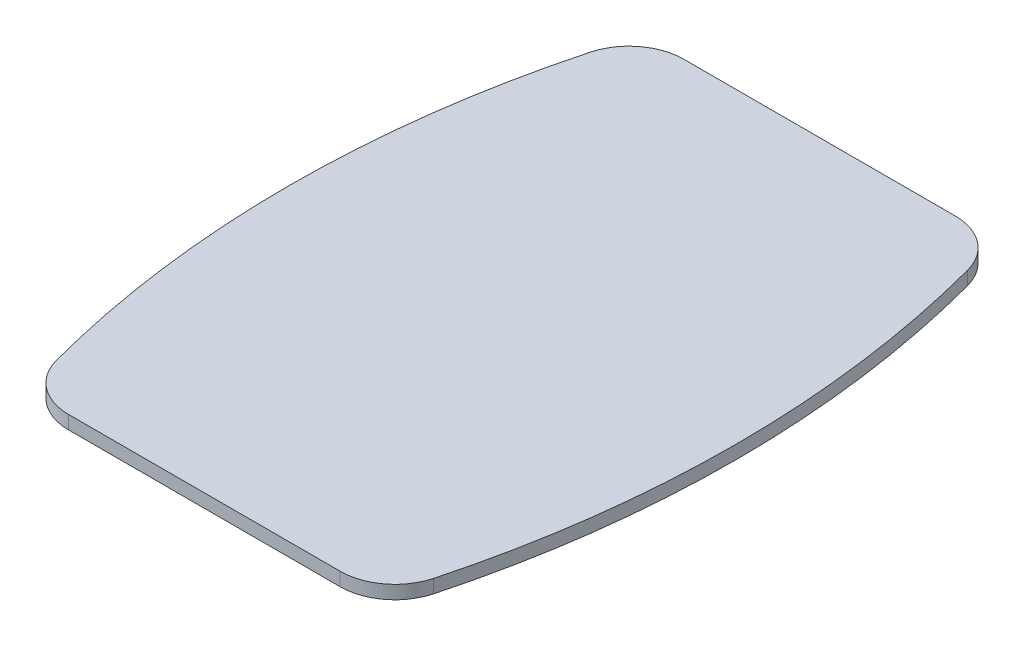
ISO-10303-21;
HEADER;
FILE_DESCRIPTION(('STEP AP214'),'2;1');
FILE_NAME('part.step','',(''),(''),'','','');
FILE_SCHEMA(('AUTOMOTIVE_DESIGN { 1 0 10303 214 1 1 1 1 }'));
ENDSEC;
DATA;
#1=APPLICATION_CONTEXT('core data for automotive mechanical design processes');
#2=APPLICATION_PROTOCOL_DEFINITION('international standard','automotive_design',2000,#1);
#3=PRODUCT_CONTEXT('',#1,'mechanical');
#4=PRODUCT('Part','Part','',(#3));
#5=PRODUCT_RELATED_PRODUCT_CATEGORY('part','',(#4));
#6=PRODUCT_DEFINITION_FORMATION('','',#4);
#7=PRODUCT_DEFINITION_CONTEXT('part definition',#1,'design');
#8=PRODUCT_DEFINITION('design','',#6,#7);
#9=PRODUCT_DEFINITION_SHAPE('','',#8);
#10=(LENGTH_UNIT() NAMED_UNIT(*) SI_UNIT(.MILLI.,.METRE.));
#11=(NAMED_UNIT(*) PLANE_ANGLE_UNIT() SI_UNIT($,.RADIAN.));
#12=(NAMED_UNIT(*) SI_UNIT($,.STERADIAN.) SOLID_ANGLE_UNIT());
#13=UNCERTAINTY_MEASURE_WITH_UNIT(LENGTH_MEASURE(1.E-05),#10,'distance_accuracy_value','');
#14=(GEOMETRIC_REPRESENTATION_CONTEXT(3) GLOBAL_UNCERTAINTY_ASSIGNED_CONTEXT((#13)) GLOBAL_UNIT_ASSIGNED_CONTEXT((#10,
#11,#12)) REPRESENTATION_CONTEXT('',''));
#15=CARTESIAN_POINT('',(0.,0.,0.));
#16=DIRECTION('',(0.,0.,1.));
#17=DIRECTION('',(1.,0.,0.));
#18=AXIS2_PLACEMENT_3D('',#15,#16,#17);
#19=CARTESIAN_POINT('',(-12.1418790973248,-12.7,22.60959767014));
#20=DIRECTION('',(0.,-1.,0.));
#21=DIRECTION('',(0.,0.,-1.));
#22=AXIS2_PLACEMENT_3D('',#19,#20,#21);
#23=PLANE('',#22);
#24=CARTESIAN_POINT('',(-12.1418790973248,-12.7,22.60959767014));
#25=DIRECTION('',(0.,-1.,0.));
#26=DIRECTION('',(0.,0.,-1.));
#27=AXIS2_PLACEMENT_3D('',#24,#25,#26);
#28=CIRCLE('',#27,4.9);
#29=CARTESIAN_POINT('',(-12.1418790973248,-12.7,27.50959767014));
#30=VERTEX_POINT('',#29);
#31=CARTESIAN_POINT('',(-16.8758947600633,-12.7,23.8741512296805));
#32=VERTEX_POINT('',#31);
#33=EDGE_CURVE('E124',#30,#32,#28,.T.);
#34=ORIENTED_EDGE('',*,*,#33,.T.);
#35=CARTESIAN_POINT('',(72.4999999999531,-12.7,0.));
#36=DIRECTION('',(0.,-1.,0.));
#37=DIRECTION('',(0.,0.,-1.));
#38=AXIS2_PLACEMENT_3D('',#35,#36,#37);
#39=CIRCLE('',#38,92.5095976701401);
#40=CARTESIAN_POINT('',(-16.8758947600633,-12.7,-23.8741512296804));
#41=VERTEX_POINT('',#40);
#42=EDGE_CURVE('E113',#32,#41,#39,.T.);
#43=ORIENTED_EDGE('',*,*,#42,.T.);
#44=CARTESIAN_POINT('',(-12.1418790973248,-12.7,-22.6095976701399));
#45=DIRECTION('',(0.,-1.,0.));
#46=DIRECTION('',(0.,0.,-1.));
#47=AXIS2_PLACEMENT_3D('',#44,#45,#46);
#48=CIRCLE('',#47,4.90000000000001);
#49=CARTESIAN_POINT('',(-12.1418790973248,-12.7,-27.5095976701399));
#50=VERTEX_POINT('',#49);
#51=EDGE_CURVE('E123',#41,#50,#48,.T.);
#52=ORIENTED_EDGE('',*,*,#51,.T.);
#53=DIRECTION('',(1.,0.,0.));
#54=VECTOR('',#53,1.);
#55=CARTESIAN_POINT('',(-12.1418790973248,-12.7,-27.5095976701399));
#56=LINE('',#55,#54);
#57=CARTESIAN_POINT('',(12.1418790973248,-12.7,-27.50959767014));
#58=VERTEX_POINT('',#57);
#59=EDGE_CURVE('E226',#50,#58,#56,.T.);
#60=ORIENTED_EDGE('',*,*,#59,.T.);
#61=CARTESIAN_POINT('',(12.1418790973248,-12.7,-22.60959767014));
#62=DIRECTION('',(0.,-1.,0.));
#63=DIRECTION('',(0.,0.,-1.));
#64=AXIS2_PLACEMENT_3D('',#61,#62,#63);
#65=CIRCLE('',#64,4.90000000000001);
#66=CARTESIAN_POINT('',(16.8758947600633,-12.7,-23.8741512296805));
#67=VERTEX_POINT('',#66);
#68=EDGE_CURVE('E240',#58,#67,#65,.T.);
#69=ORIENTED_EDGE('',*,*,#68,.T.);
#70=CARTESIAN_POINT('',(-72.4999999999531,-12.7,0.));
#71=DIRECTION('',(0.,-1.,0.));
#72=DIRECTION('',(0.,0.,-1.));
#73=AXIS2_PLACEMENT_3D('',#70,#71,#72);
#74=CIRCLE('',#73,92.5095976701401);
#75=CARTESIAN_POINT('',(16.8758947600633,-12.7,23.8741512296805));
#76=VERTEX_POINT('',#75);
#77=EDGE_CURVE('E238',#67,#76,#74,.T.);
#78=ORIENTED_EDGE('',*,*,#77,.T.);
#79=CARTESIAN_POINT('',(12.1418790973248,-12.7,22.6095976701399));
#80=DIRECTION('',(0.,-1.,0.));
#81=DIRECTION('',(0.,0.,-1.));
#82=AXIS2_PLACEMENT_3D('',#79,#80,#81);
#83=CIRCLE('',#82,4.90000000000002);
#84=CARTESIAN_POINT('',(12.1418790973248,-12.7,27.5095976701399));
#85=VERTEX_POINT('',#84);
#86=EDGE_CURVE('E242',#76,#85,#83,.T.);
#87=ORIENTED_EDGE('',*,*,#86,.T.);
#88=DIRECTION('',(-1.,0.,0.));
#89=VECTOR('',#88,1.);
#90=CARTESIAN_POINT('',(12.1418790973248,-12.7,27.5095976701399));
#91=LINE('',#90,#89);
#92=EDGE_CURVE('E129',#85,#30,#91,.T.);
#93=ORIENTED_EDGE('',*,*,#92,.T.);
#94=EDGE_LOOP('',(#34,#43,#52,#60,#69,#78,#87,#93));
#95=FACE_BOUND('',#94,.T.);
#96=DIRECTION('',(-1.,0.,0.));
#97=VECTOR('',#96,1.);
#98=CARTESIAN_POINT('',(-12.1418790973248,-12.7,-14.8599756298331));
#99=LINE('',#98,#97);
#100=CARTESIAN_POINT('',(14.0299535443694,-12.7,-14.8599756298331));
#101=VERTEX_POINT('',#100);
#102=CARTESIAN_POINT('',(-14.0299535443694,-12.7,-14.8599756298331));
#103=VERTEX_POINT('',#102);
#104=EDGE_CURVE('E49',#101,#103,#99,.T.);
#105=ORIENTED_EDGE('',*,*,#104,.T.);
#106=DIRECTION('',(0.,0.,1.));
#107=VECTOR('',#106,1.);
#108=CARTESIAN_POINT('',(-14.0299535443694,-12.7,22.60959767014));
#109=LINE('',#108,#107);
#110=CARTESIAN_POINT('',(-14.0299535443694,-12.7,20.1999980960807));
#111=VERTEX_POINT('',#110);
#112=EDGE_CURVE('E11',#103,#111,#109,.T.);
#113=ORIENTED_EDGE('',*,*,#112,.T.);
#114=DIRECTION('',(1.,0.,0.));
#115=VECTOR('',#114,1.);
#116=CARTESIAN_POINT('',(-12.1418790973248,-12.7,20.1999980960807));
#117=LINE('',#116,#115);
#118=CARTESIAN_POINT('',(14.0299535443694,-12.7,20.1999980960807));
#119=VERTEX_POINT('',#118);
#120=EDGE_CURVE('E137',#111,#119,#117,.T.);
#121=ORIENTED_EDGE('',*,*,#120,.T.);
#122=DIRECTION('',(0.,0.,-1.));
#123=VECTOR('',#122,1.);
#124=CARTESIAN_POINT('',(14.0299535443694,-12.7,22.60959767014));
#125=LINE('',#124,#123);
#126=EDGE_CURVE('E141',#119,#101,#125,.T.);
#127=ORIENTED_EDGE('',*,*,#126,.T.);
#128=EDGE_LOOP('',(#105,#113,#121,#127));
#129=FACE_BOUND('',#128,.T.);
#130=ADVANCED_FACE('F40',(#95,#129),#23,.T.);
#131=CARTESIAN_POINT('',(-12.1418790973248,-12.7,22.60959767014));
#132=DIRECTION('',(0.,1.,0.));
#133=DIRECTION('',(0.,0.,1.));
#134=AXIS2_PLACEMENT_3D('',#131,#132,#133);
#135=CYLINDRICAL_SURFACE('',#134,4.9);
#136=CARTESIAN_POINT('',(-12.1418790973248,-11.5,22.60959767014));
#137=DIRECTION('',(0.,-1.,0.));
#138=DIRECTION('',(0.,0.,-1.));
#139=AXIS2_PLACEMENT_3D('',#136,#137,#138);
#140=CIRCLE('',#139,4.9);
#141=CARTESIAN_POINT('',(-12.1418790973248,-11.5,27.50959767014));
#142=VERTEX_POINT('',#141);
#143=CARTESIAN_POINT('',(-16.8758947600633,-11.5,23.8741512296805));
#144=VERTEX_POINT('',#143);
#145=EDGE_CURVE('E136',#142,#144,#140,.T.);
#146=ORIENTED_EDGE('',*,*,#145,.T.);
#147=DIRECTION('',(0.,1.,0.));
#148=VECTOR('',#147,1.);
#149=CARTESIAN_POINT('',(-16.8758947600633,-12.7,23.8741512296805));
#150=LINE('',#149,#148);
#151=EDGE_CURVE('E117',#32,#144,#150,.T.);
#152=ORIENTED_EDGE('',*,*,#151,.F.);
#153=ORIENTED_EDGE('',*,*,#33,.F.);
#154=DIRECTION('',(0.,1.,0.));
#155=VECTOR('',#154,1.);
#156=CARTESIAN_POINT('',(-12.1418790973248,-12.7,27.50959767014));
#157=LINE('',#156,#155);
#158=EDGE_CURVE('E208',#30,#142,#157,.T.);
#159=ORIENTED_EDGE('',*,*,#158,.T.);
#160=EDGE_LOOP('',(#146,#152,#153,#159));
#161=FACE_BOUND('',#160,.T.);
#162=ADVANCED_FACE('F42',(#161),#135,.T.);
#163=CARTESIAN_POINT('',(72.4999999999531,-12.7,0.));
#164=DIRECTION('',(0.,1.,0.));
#165=DIRECTION('',(0.,0.,1.));
#166=AXIS2_PLACEMENT_3D('',#163,#164,#165);
#167=CYLINDRICAL_SURFACE('',#166,92.5095976701401);
#168=CARTESIAN_POINT('',(72.4999999999531,-11.5,0.));
#169=DIRECTION('',(0.,-1.,0.));
#170=DIRECTION('',(0.,0.,-1.));
#171=AXIS2_PLACEMENT_3D('',#168,#169,#170);
#172=CIRCLE('',#171,92.5095976701401);
#173=CARTESIAN_POINT('',(-16.8758947600633,-11.5,-23.8741512296804));
#174=VERTEX_POINT('',#173);
#175=EDGE_CURVE('E233',#144,#174,#172,.T.);
#176=ORIENTED_EDGE('',*,*,#175,.T.);
#177=DIRECTION('',(0.,1.,0.));
#178=VECTOR('',#177,1.);
#179=CARTESIAN_POINT('',(-16.8758947600633,-12.7,-23.8741512296804));
#180=LINE('',#179,#178);
#181=EDGE_CURVE('E120',#41,#174,#180,.T.);
#182=ORIENTED_EDGE('',*,*,#181,.F.);
#183=ORIENTED_EDGE('',*,*,#42,.F.);
#184=ORIENTED_EDGE('',*,*,#151,.T.);
#185=EDGE_LOOP('',(#176,#182,#183,#184));
#186=FACE_BOUND('',#185,.T.);
#187=ADVANCED_FACE('F115',(#186),#167,.T.);
#188=CARTESIAN_POINT('',(-12.1418790973248,-12.7,-22.6095976701399));
#189=DIRECTION('',(0.,1.,0.));
#190=DIRECTION('',(0.,0.,1.));
#191=AXIS2_PLACEMENT_3D('',#188,#189,#190);
#192=CYLINDRICAL_SURFACE('',#191,4.90000000000001);
#193=CARTESIAN_POINT('',(-12.1418790973248,-11.5,-22.6095976701399));
#194=DIRECTION('',(0.,-1.,0.));
#195=DIRECTION('',(0.,0.,-1.));
#196=AXIS2_PLACEMENT_3D('',#193,#194,#195);
#197=CIRCLE('',#196,4.90000000000001);
#198=CARTESIAN_POINT('',(-12.1418790973248,-11.5,-27.5095976701399));
#199=VERTEX_POINT('',#198);
#200=EDGE_CURVE('E229',#174,#199,#197,.T.);
#201=ORIENTED_EDGE('',*,*,#200,.T.);
#202=DIRECTION('',(0.,1.,0.));
#203=VECTOR('',#202,1.);
#204=CARTESIAN_POINT('',(-12.1418790973248,-12.7,-27.5095976701399));
#205=LINE('',#204,#203);
#206=EDGE_CURVE('E143',#50,#199,#205,.T.);
#207=ORIENTED_EDGE('',*,*,#206,.F.);
#208=ORIENTED_EDGE('',*,*,#51,.F.);
#209=ORIENTED_EDGE('',*,*,#181,.T.);
#210=EDGE_LOOP('',(#201,#207,#208,#209));
#211=FACE_BOUND('',#210,.T.);
#212=ADVANCED_FACE('F172',(#211),#192,.T.);
#213=CARTESIAN_POINT('',(-12.1418790973248,-12.7,-27.5095976701399));
#214=DIRECTION('',(0.,0.,1.));
#215=DIRECTION('',(1.,0.,0.));
#216=AXIS2_PLACEMENT_3D('',#213,#214,#215);
#217=PLANE('',#216);
#218=DIRECTION('',(1.,0.,0.));
#219=VECTOR('',#218,1.);
#220=CARTESIAN_POINT('',(-12.1418790973248,-11.5,-27.5095976701399));
#221=LINE('',#220,#219);
#222=CARTESIAN_POINT('',(12.1418790973248,-11.5,-27.50959767014));
#223=VERTEX_POINT('',#222);
#224=EDGE_CURVE('E225',#199,#223,#221,.T.);
#225=ORIENTED_EDGE('',*,*,#224,.T.);
#226=DIRECTION('',(0.,1.,0.));
#227=VECTOR('',#226,1.);
#228=CARTESIAN_POINT('',(12.1418790973248,-12.7,-27.50959767014));
#229=LINE('',#228,#227);
#230=EDGE_CURVE('E218',#58,#223,#229,.T.);
#231=ORIENTED_EDGE('',*,*,#230,.F.);
#232=ORIENTED_EDGE('',*,*,#59,.F.);
#233=ORIENTED_EDGE('',*,*,#206,.T.);
#234=EDGE_LOOP('',(#225,#231,#232,#233));
#235=FACE_BOUND('',#234,.T.);
#236=ADVANCED_FACE('F176',(#235),#217,.F.);
#237=CARTESIAN_POINT('',(12.1418790973248,-12.7,-22.60959767014));
#238=DIRECTION('',(0.,1.,0.));
#239=DIRECTION('',(0.,0.,1.));
#240=AXIS2_PLACEMENT_3D('',#237,#238,#239);
#241=CYLINDRICAL_SURFACE('',#240,4.90000000000001);
#242=CARTESIAN_POINT('',(12.1418790973248,-11.5,-22.60959767014));
#243=DIRECTION('',(0.,-1.,0.));
#244=DIRECTION('',(0.,0.,-1.));
#245=AXIS2_PLACEMENT_3D('',#242,#243,#244);
#246=CIRCLE('',#245,4.90000000000001);
#247=CARTESIAN_POINT('',(16.8758947600633,-11.5,-23.8741512296805));
#248=VERTEX_POINT('',#247);
#249=EDGE_CURVE('E230',#223,#248,#246,.T.);
#250=ORIENTED_EDGE('',*,*,#249,.T.);
#251=DIRECTION('',(0.,1.,0.));
#252=VECTOR('',#251,1.);
#253=CARTESIAN_POINT('',(16.8758947600633,-12.7,-23.8741512296805));
#254=LINE('',#253,#252);
#255=EDGE_CURVE('E215',#67,#248,#254,.T.);
#256=ORIENTED_EDGE('',*,*,#255,.F.);
#257=ORIENTED_EDGE('',*,*,#68,.F.);
#258=ORIENTED_EDGE('',*,*,#230,.T.);
#259=EDGE_LOOP('',(#250,#256,#257,#258));
#260=FACE_BOUND('',#259,.T.);
#261=ADVANCED_FACE('F182',(#260),#241,.T.);
#262=CARTESIAN_POINT('',(-72.4999999999531,-12.7,0.));
#263=DIRECTION('',(0.,1.,0.));
#264=DIRECTION('',(0.,0.,1.));
#265=AXIS2_PLACEMENT_3D('',#262,#263,#264);
#266=CYLINDRICAL_SURFACE('',#265,92.5095976701401);
#267=CARTESIAN_POINT('',(-72.4999999999531,-11.5,0.));
#268=DIRECTION('',(0.,-1.,0.));
#269=DIRECTION('',(0.,0.,-1.));
#270=AXIS2_PLACEMENT_3D('',#267,#268,#269);
#271=CIRCLE('',#270,92.5095976701401);
#272=CARTESIAN_POINT('',(16.8758947600633,-11.5,23.8741512296805));
#273=VERTEX_POINT('',#272);
#274=EDGE_CURVE('E206',#248,#273,#271,.T.);
#275=ORIENTED_EDGE('',*,*,#274,.T.);
#276=DIRECTION('',(0.,1.,0.));
#277=VECTOR('',#276,1.);
#278=CARTESIAN_POINT('',(16.8758947600633,-12.7,23.8741512296805));
#279=LINE('',#278,#277);
#280=EDGE_CURVE('E203',#76,#273,#279,.T.);
#281=ORIENTED_EDGE('',*,*,#280,.F.);
#282=ORIENTED_EDGE('',*,*,#77,.F.);
#283=ORIENTED_EDGE('',*,*,#255,.T.);
#284=EDGE_LOOP('',(#275,#281,#282,#283));
#285=FACE_BOUND('',#284,.T.);
#286=ADVANCED_FACE('F186',(#285),#266,.T.);
#287=CARTESIAN_POINT('',(12.1418790973248,-12.7,22.6095976701399));
#288=DIRECTION('',(0.,1.,0.));
#289=DIRECTION('',(0.,0.,1.));
#290=AXIS2_PLACEMENT_3D('',#287,#288,#289);
#291=CYLINDRICAL_SURFACE('',#290,4.90000000000002);
#292=CARTESIAN_POINT('',(12.1418790973248,-11.5,22.6095976701399));
#293=DIRECTION('',(0.,-1.,0.));
#294=DIRECTION('',(0.,0.,-1.));
#295=AXIS2_PLACEMENT_3D('',#292,#293,#294);
#296=CIRCLE('',#295,4.90000000000002);
#297=CARTESIAN_POINT('',(12.1418790973248,-11.5,27.5095976701399));
#298=VERTEX_POINT('',#297);
#299=EDGE_CURVE('E198',#273,#298,#296,.T.);
#300=ORIENTED_EDGE('',*,*,#299,.T.);
#301=DIRECTION('',(0.,1.,0.));
#302=VECTOR('',#301,1.);
#303=CARTESIAN_POINT('',(12.1418790973248,-12.7,27.5095976701399));
#304=LINE('',#303,#302);
#305=EDGE_CURVE('E201',#85,#298,#304,.T.);
#306=ORIENTED_EDGE('',*,*,#305,.F.);
#307=ORIENTED_EDGE('',*,*,#86,.F.);
#308=ORIENTED_EDGE('',*,*,#280,.T.);
#309=EDGE_LOOP('',(#300,#306,#307,#308));
#310=FACE_BOUND('',#309,.T.);
#311=ADVANCED_FACE('F162',(#310),#291,.T.);
#312=CARTESIAN_POINT('',(12.1418790973248,-12.7,27.5095976701399));
#313=DIRECTION('',(0.,0.,-1.));
#314=DIRECTION('',(-1.,0.,0.));
#315=AXIS2_PLACEMENT_3D('',#312,#313,#314);
#316=PLANE('',#315);
#317=DIRECTION('',(-1.,0.,0.));
#318=VECTOR('',#317,1.);
#319=CARTESIAN_POINT('',(12.1418790973248,-11.5,27.5095976701399));
#320=LINE('',#319,#318);
#321=EDGE_CURVE('E133',#298,#142,#320,.T.);
#322=ORIENTED_EDGE('',*,*,#321,.T.);
#323=ORIENTED_EDGE('',*,*,#158,.F.);
#324=ORIENTED_EDGE('',*,*,#92,.F.);
#325=ORIENTED_EDGE('',*,*,#305,.T.);
#326=EDGE_LOOP('',(#322,#323,#324,#325));
#327=FACE_BOUND('',#326,.T.);
#328=ADVANCED_FACE('F154',(#327),#316,.F.);
#329=ORIENTED_EDGE('',*,*,#112,.F.);
#330=ORIENTED_EDGE('',*,*,#104,.F.);
#331=ORIENTED_EDGE('',*,*,#126,.F.);
#332=ORIENTED_EDGE('',*,*,#120,.F.);
#333=EDGE_LOOP('',(#329,#330,#331,#332));
#334=FACE_BOUND('',#333,.T.);
#335=ADVANCED_FACE('F151',(#334),#23,.T.);
#336=CARTESIAN_POINT('',(-12.1418790973248,-11.5,22.60959767014));
#337=DIRECTION('',(0.,-1.,0.));
#338=DIRECTION('',(0.,0.,-1.));
#339=AXIS2_PLACEMENT_3D('',#336,#337,#338);
#340=PLANE('',#339);
#341=ORIENTED_EDGE('',*,*,#145,.F.);
#342=ORIENTED_EDGE('',*,*,#321,.F.);
#343=ORIENTED_EDGE('',*,*,#299,.F.);
#344=ORIENTED_EDGE('',*,*,#274,.F.);
#345=ORIENTED_EDGE('',*,*,#249,.F.);
#346=ORIENTED_EDGE('',*,*,#224,.F.);
#347=ORIENTED_EDGE('',*,*,#200,.F.);
#348=ORIENTED_EDGE('',*,*,#175,.F.);
#349=EDGE_LOOP('',(#341,#342,#343,#344,#345,#346,#347,#348));
#350=FACE_BOUND('',#349,.T.);
#351=ADVANCED_FACE('F153',(#350),#340,.F.);
#352=CLOSED_SHELL('',(#130,#162,#187,#212,#236,#261,#286,#311,#328,#335,#351));
#353=MANIFOLD_SOLID_BREP('B2',#352);
#354=ADVANCED_BREP_SHAPE_REPRESENTATION('',(#18,#353),#14);
#355=SHAPE_DEFINITION_REPRESENTATION(#9,#354);
ENDSEC;
END-ISO-10303-21;
